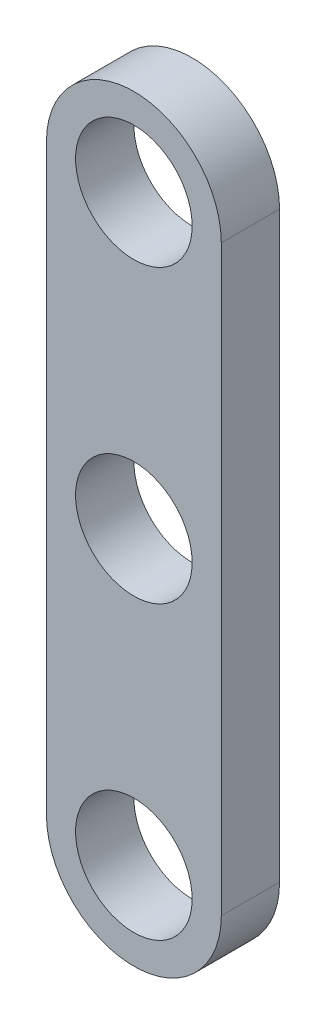
ISO-10303-21;
HEADER;
FILE_DESCRIPTION(('STEP AP214'),'2;1');
FILE_NAME('part.step','',(''),(''),'','','');
FILE_SCHEMA(('AUTOMOTIVE_DESIGN { 1 0 10303 214 1 1 1 1 }'));
ENDSEC;
DATA;
#1=APPLICATION_CONTEXT('core data for automotive mechanical design processes');
#2=APPLICATION_PROTOCOL_DEFINITION('international standard','automotive_design',2000,#1);
#3=PRODUCT_CONTEXT('',#1,'mechanical');
#4=PRODUCT('Part','Part','',(#3));
#5=PRODUCT_RELATED_PRODUCT_CATEGORY('part','',(#4));
#6=PRODUCT_DEFINITION_FORMATION('','',#4);
#7=PRODUCT_DEFINITION_CONTEXT('part definition',#1,'design');
#8=PRODUCT_DEFINITION('design','',#6,#7);
#9=PRODUCT_DEFINITION_SHAPE('','',#8);
#10=(LENGTH_UNIT() NAMED_UNIT(*) SI_UNIT(.MILLI.,.METRE.));
#11=(NAMED_UNIT(*) PLANE_ANGLE_UNIT() SI_UNIT($,.RADIAN.));
#12=(NAMED_UNIT(*) SI_UNIT($,.STERADIAN.) SOLID_ANGLE_UNIT());
#13=UNCERTAINTY_MEASURE_WITH_UNIT(LENGTH_MEASURE(1.E-05),#10,'distance_accuracy_value','');
#14=(GEOMETRIC_REPRESENTATION_CONTEXT(3) GLOBAL_UNCERTAINTY_ASSIGNED_CONTEXT((#13)) GLOBAL_UNIT_ASSIGNED_CONTEXT((#10,
#11,#12)) REPRESENTATION_CONTEXT('',''));
#15=CARTESIAN_POINT('',(0.,0.,0.));
#16=DIRECTION('',(0.,0.,1.));
#17=DIRECTION('',(1.,0.,0.));
#18=AXIS2_PLACEMENT_3D('',#15,#16,#17);
#19=CARTESIAN_POINT('',(0.,17.5,0.75));
#20=DIRECTION('',(0.,0.,1.));
#21=DIRECTION('',(1.,0.,0.));
#22=AXIS2_PLACEMENT_3D('',#19,#20,#21);
#23=PLANE('',#22);
#24=CARTESIAN_POINT('',(0.,25.,0.75));
#25=DIRECTION('',(0.,0.,1.));
#26=DIRECTION('',(1.,0.,0.));
#27=AXIS2_PLACEMENT_3D('',#24,#25,#26);
#28=CIRCLE('',#27,1.5);
#29=CARTESIAN_POINT('',(1.5,25.,0.75));
#30=VERTEX_POINT('',#29);
#31=EDGE_CURVE('E140',#30,#30,#28,.T.);
#32=ORIENTED_EDGE('',*,*,#31,.F.);
#33=EDGE_LOOP('',(#32));
#34=FACE_BOUND('',#33,.T.);
#35=CARTESIAN_POINT('',(0.,17.5,0.75));
#36=DIRECTION('',(0.,0.,1.));
#37=DIRECTION('',(1.,0.,0.));
#38=AXIS2_PLACEMENT_3D('',#35,#36,#37);
#39=CIRCLE('',#38,2.25);
#40=CARTESIAN_POINT('',(-2.25,17.5,0.75));
#41=VERTEX_POINT('',#40);
#42=CARTESIAN_POINT('',(2.25,17.5,0.75));
#43=VERTEX_POINT('',#42);
#44=EDGE_CURVE('E98',#41,#43,#39,.T.);
#45=ORIENTED_EDGE('',*,*,#44,.T.);
#46=DIRECTION('',(0.,1.,0.));
#47=VECTOR('',#46,1.);
#48=CARTESIAN_POINT('',(2.25,17.5,0.75));
#49=LINE('',#48,#47);
#50=CARTESIAN_POINT('',(2.24999999999999,32.5,0.75));
#51=VERTEX_POINT('',#50);
#52=EDGE_CURVE('E93',#43,#51,#49,.T.);
#53=ORIENTED_EDGE('',*,*,#52,.T.);
#54=CARTESIAN_POINT('',(0.,32.5,0.75));
#55=DIRECTION('',(0.,0.,1.));
#56=DIRECTION('',(1.,0.,0.));
#57=AXIS2_PLACEMENT_3D('',#54,#55,#56);
#58=CIRCLE('',#57,2.25);
#59=CARTESIAN_POINT('',(-2.25000000000001,32.5,0.75));
#60=VERTEX_POINT('',#59);
#61=EDGE_CURVE('E96',#51,#60,#58,.T.);
#62=ORIENTED_EDGE('',*,*,#61,.T.);
#63=DIRECTION('',(0.,-1.,0.));
#64=VECTOR('',#63,1.);
#65=CARTESIAN_POINT('',(-2.25,17.5,0.75));
#66=LINE('',#65,#64);
#67=EDGE_CURVE('E63',#60,#41,#66,.T.);
#68=ORIENTED_EDGE('',*,*,#67,.T.);
#69=EDGE_LOOP('',(#45,#53,#62,#68));
#70=FACE_BOUND('',#69,.T.);
#71=CARTESIAN_POINT('',(0.,32.5,0.75));
#72=DIRECTION('',(0.,0.,1.));
#73=DIRECTION('',(1.,0.,0.));
#74=AXIS2_PLACEMENT_3D('',#71,#72,#73);
#75=CIRCLE('',#74,1.5);
#76=CARTESIAN_POINT('',(1.49999999999999,32.5,0.75));
#77=VERTEX_POINT('',#76);
#78=EDGE_CURVE('E118',#77,#77,#75,.T.);
#79=ORIENTED_EDGE('',*,*,#78,.F.);
#80=EDGE_LOOP('',(#79));
#81=FACE_BOUND('',#80,.T.);
#82=CARTESIAN_POINT('',(0.,17.5,0.75));
#83=DIRECTION('',(0.,0.,1.));
#84=DIRECTION('',(1.,0.,0.));
#85=AXIS2_PLACEMENT_3D('',#82,#83,#84);
#86=CIRCLE('',#85,1.5);
#87=CARTESIAN_POINT('',(1.5,17.5,0.75));
#88=VERTEX_POINT('',#87);
#89=EDGE_CURVE('E148',#88,#88,#86,.T.);
#90=ORIENTED_EDGE('',*,*,#89,.F.);
#91=EDGE_LOOP('',(#90));
#92=FACE_BOUND('',#91,.T.);
#93=ADVANCED_FACE('F45',(#34,#70,#81,#92),#23,.T.);
#94=CARTESIAN_POINT('',(0.,17.5,-0.75));
#95=DIRECTION('',(0.,0.,1.));
#96=DIRECTION('',(1.,0.,0.));
#97=AXIS2_PLACEMENT_3D('',#94,#95,#96);
#98=PLANE('',#97);
#99=CARTESIAN_POINT('',(0.,17.5,-0.75));
#100=DIRECTION('',(0.,0.,1.));
#101=DIRECTION('',(1.,0.,0.));
#102=AXIS2_PLACEMENT_3D('',#99,#100,#101);
#103=CIRCLE('',#102,2.25);
#104=CARTESIAN_POINT('',(-2.25,17.5,-0.75));
#105=VERTEX_POINT('',#104);
#106=CARTESIAN_POINT('',(2.25,17.5,-0.75));
#107=VERTEX_POINT('',#106);
#108=EDGE_CURVE('E114',#105,#107,#103,.T.);
#109=ORIENTED_EDGE('',*,*,#108,.F.);
#110=DIRECTION('',(0.,-1.,0.));
#111=VECTOR('',#110,1.);
#112=CARTESIAN_POINT('',(-2.25,17.5,-0.75));
#113=LINE('',#112,#111);
#114=CARTESIAN_POINT('',(-2.25000000000001,32.5,-0.75));
#115=VERTEX_POINT('',#114);
#116=EDGE_CURVE('E86',#115,#105,#113,.T.);
#117=ORIENTED_EDGE('',*,*,#116,.F.);
#118=CARTESIAN_POINT('',(0.,32.5,-0.75));
#119=DIRECTION('',(0.,0.,1.));
#120=DIRECTION('',(1.,0.,0.));
#121=AXIS2_PLACEMENT_3D('',#118,#119,#120);
#122=CIRCLE('',#121,2.25);
#123=CARTESIAN_POINT('',(2.24999999999999,32.5,-0.75));
#124=VERTEX_POINT('',#123);
#125=EDGE_CURVE('E80',#124,#115,#122,.T.);
#126=ORIENTED_EDGE('',*,*,#125,.F.);
#127=DIRECTION('',(0.,1.,0.));
#128=VECTOR('',#127,1.);
#129=CARTESIAN_POINT('',(2.25,17.5,-0.75));
#130=LINE('',#129,#128);
#131=EDGE_CURVE('E103',#107,#124,#130,.T.);
#132=ORIENTED_EDGE('',*,*,#131,.F.);
#133=EDGE_LOOP('',(#109,#117,#126,#132));
#134=FACE_BOUND('',#133,.T.);
#135=CARTESIAN_POINT('',(0.,32.5,-0.75));
#136=DIRECTION('',(0.,0.,1.));
#137=DIRECTION('',(1.,0.,0.));
#138=AXIS2_PLACEMENT_3D('',#135,#136,#137);
#139=CIRCLE('',#138,1.5);
#140=CARTESIAN_POINT('',(1.49999999999999,32.5,-0.75));
#141=VERTEX_POINT('',#140);
#142=EDGE_CURVE('E136',#141,#141,#139,.T.);
#143=ORIENTED_EDGE('',*,*,#142,.T.);
#144=EDGE_LOOP('',(#143));
#145=FACE_BOUND('',#144,.T.);
#146=CARTESIAN_POINT('',(0.,25.,-0.75));
#147=DIRECTION('',(0.,0.,1.));
#148=DIRECTION('',(1.,0.,0.));
#149=AXIS2_PLACEMENT_3D('',#146,#147,#148);
#150=CIRCLE('',#149,1.5);
#151=CARTESIAN_POINT('',(1.5,25.,-0.75));
#152=VERTEX_POINT('',#151);
#153=EDGE_CURVE('E144',#152,#152,#150,.T.);
#154=ORIENTED_EDGE('',*,*,#153,.T.);
#155=EDGE_LOOP('',(#154));
#156=FACE_BOUND('',#155,.T.);
#157=CARTESIAN_POINT('',(0.,17.5,-0.75));
#158=DIRECTION('',(0.,0.,1.));
#159=DIRECTION('',(1.,0.,0.));
#160=AXIS2_PLACEMENT_3D('',#157,#158,#159);
#161=CIRCLE('',#160,1.5);
#162=CARTESIAN_POINT('',(1.5,17.5,-0.75));
#163=VERTEX_POINT('',#162);
#164=EDGE_CURVE('E152',#163,#163,#161,.T.);
#165=ORIENTED_EDGE('',*,*,#164,.T.);
#166=EDGE_LOOP('',(#165));
#167=FACE_BOUND('',#166,.T.);
#168=ADVANCED_FACE('F131',(#134,#145,#156,#167),#98,.F.);
#169=CARTESIAN_POINT('',(0.,17.5,0.75));
#170=DIRECTION('',(0.,0.,-1.));
#171=DIRECTION('',(-1.,0.,0.));
#172=AXIS2_PLACEMENT_3D('',#169,#170,#171);
#173=CYLINDRICAL_SURFACE('',#172,2.25);
#174=ORIENTED_EDGE('',*,*,#108,.T.);
#175=DIRECTION('',(0.,0.,-1.));
#176=VECTOR('',#175,1.);
#177=CARTESIAN_POINT('',(2.25,17.5,0.75));
#178=LINE('',#177,#176);
#179=EDGE_CURVE('E11',#43,#107,#178,.T.);
#180=ORIENTED_EDGE('',*,*,#179,.F.);
#181=ORIENTED_EDGE('',*,*,#44,.F.);
#182=DIRECTION('',(0.,0.,-1.));
#183=VECTOR('',#182,1.);
#184=CARTESIAN_POINT('',(-2.25,17.5,0.75));
#185=LINE('',#184,#183);
#186=EDGE_CURVE('E110',#41,#105,#185,.T.);
#187=ORIENTED_EDGE('',*,*,#186,.T.);
#188=EDGE_LOOP('',(#174,#180,#181,#187));
#189=FACE_BOUND('',#188,.T.);
#190=ADVANCED_FACE('F47',(#189),#173,.T.);
#191=CARTESIAN_POINT('',(2.25,17.5,0.75));
#192=DIRECTION('',(-1.,0.,0.));
#193=DIRECTION('',(0.,-1.,0.));
#194=AXIS2_PLACEMENT_3D('',#191,#192,#193);
#195=PLANE('',#194);
#196=ORIENTED_EDGE('',*,*,#131,.T.);
#197=DIRECTION('',(0.,0.,-1.));
#198=VECTOR('',#197,1.);
#199=CARTESIAN_POINT('',(2.24999999999999,32.5,0.75));
#200=LINE('',#199,#198);
#201=EDGE_CURVE('E55',#51,#124,#200,.T.);
#202=ORIENTED_EDGE('',*,*,#201,.F.);
#203=ORIENTED_EDGE('',*,*,#52,.F.);
#204=ORIENTED_EDGE('',*,*,#179,.T.);
#205=EDGE_LOOP('',(#196,#202,#203,#204));
#206=FACE_BOUND('',#205,.T.);
#207=ADVANCED_FACE('F102',(#206),#195,.F.);
#208=CARTESIAN_POINT('',(0.,32.5,0.75));
#209=DIRECTION('',(0.,0.,-1.));
#210=DIRECTION('',(-1.,0.,0.));
#211=AXIS2_PLACEMENT_3D('',#208,#209,#210);
#212=CYLINDRICAL_SURFACE('',#211,2.25);
#213=ORIENTED_EDGE('',*,*,#125,.T.);
#214=DIRECTION('',(0.,0.,-1.));
#215=VECTOR('',#214,1.);
#216=CARTESIAN_POINT('',(-2.25000000000001,32.5,0.75));
#217=LINE('',#216,#215);
#218=EDGE_CURVE('E105',#60,#115,#217,.T.);
#219=ORIENTED_EDGE('',*,*,#218,.F.);
#220=ORIENTED_EDGE('',*,*,#61,.F.);
#221=ORIENTED_EDGE('',*,*,#201,.T.);
#222=EDGE_LOOP('',(#213,#219,#220,#221));
#223=FACE_BOUND('',#222,.T.);
#224=ADVANCED_FACE('F106',(#223),#212,.T.);
#225=CARTESIAN_POINT('',(-2.25,17.5,0.75));
#226=DIRECTION('',(1.,0.,0.));
#227=DIRECTION('',(0.,1.,0.));
#228=AXIS2_PLACEMENT_3D('',#225,#226,#227);
#229=PLANE('',#228);
#230=ORIENTED_EDGE('',*,*,#116,.T.);
#231=ORIENTED_EDGE('',*,*,#186,.F.);
#232=ORIENTED_EDGE('',*,*,#67,.F.);
#233=ORIENTED_EDGE('',*,*,#218,.T.);
#234=EDGE_LOOP('',(#230,#231,#232,#233));
#235=FACE_BOUND('',#234,.T.);
#236=ADVANCED_FACE('F128',(#235),#229,.F.);
#237=CARTESIAN_POINT('',(0.,32.5,0.75));
#238=DIRECTION('',(0.,0.,-1.));
#239=DIRECTION('',(-1.,0.,0.));
#240=AXIS2_PLACEMENT_3D('',#237,#238,#239);
#241=CYLINDRICAL_SURFACE('',#240,1.5);
#242=ORIENTED_EDGE('',*,*,#78,.T.);
#243=EDGE_LOOP('',(#242));
#244=FACE_BOUND('',#243,.T.);
#245=ORIENTED_EDGE('',*,*,#142,.F.);
#246=EDGE_LOOP('',(#245));
#247=FACE_BOUND('',#246,.T.);
#248=ADVANCED_FACE('F172',(#244,#247),#241,.F.);
#249=CARTESIAN_POINT('',(0.,25.,0.75));
#250=DIRECTION('',(0.,0.,-1.));
#251=DIRECTION('',(-1.,0.,0.));
#252=AXIS2_PLACEMENT_3D('',#249,#250,#251);
#253=CYLINDRICAL_SURFACE('',#252,1.5);
#254=ORIENTED_EDGE('',*,*,#31,.T.);
#255=EDGE_LOOP('',(#254));
#256=FACE_BOUND('',#255,.T.);
#257=ORIENTED_EDGE('',*,*,#153,.F.);
#258=EDGE_LOOP('',(#257));
#259=FACE_BOUND('',#258,.T.);
#260=ADVANCED_FACE('F239',(#256,#259),#253,.F.);
#261=CARTESIAN_POINT('',(0.,17.5,0.75));
#262=DIRECTION('',(0.,0.,-1.));
#263=DIRECTION('',(-1.,0.,0.));
#264=AXIS2_PLACEMENT_3D('',#261,#262,#263);
#265=CYLINDRICAL_SURFACE('',#264,1.5);
#266=ORIENTED_EDGE('',*,*,#89,.T.);
#267=EDGE_LOOP('',(#266));
#268=FACE_BOUND('',#267,.T.);
#269=ORIENTED_EDGE('',*,*,#164,.F.);
#270=EDGE_LOOP('',(#269));
#271=FACE_BOUND('',#270,.T.);
#272=ADVANCED_FACE('F160',(#268,#271),#265,.F.);
#273=CLOSED_SHELL('',(#93,#168,#190,#207,#224,#236,#248,#260,#272));
#274=MANIFOLD_SOLID_BREP('B2',#273);
#275=ADVANCED_BREP_SHAPE_REPRESENTATION('',(#18,#274),#14);
#276=SHAPE_DEFINITION_REPRESENTATION(#9,#275);
ENDSEC;
END-ISO-10303-21;
